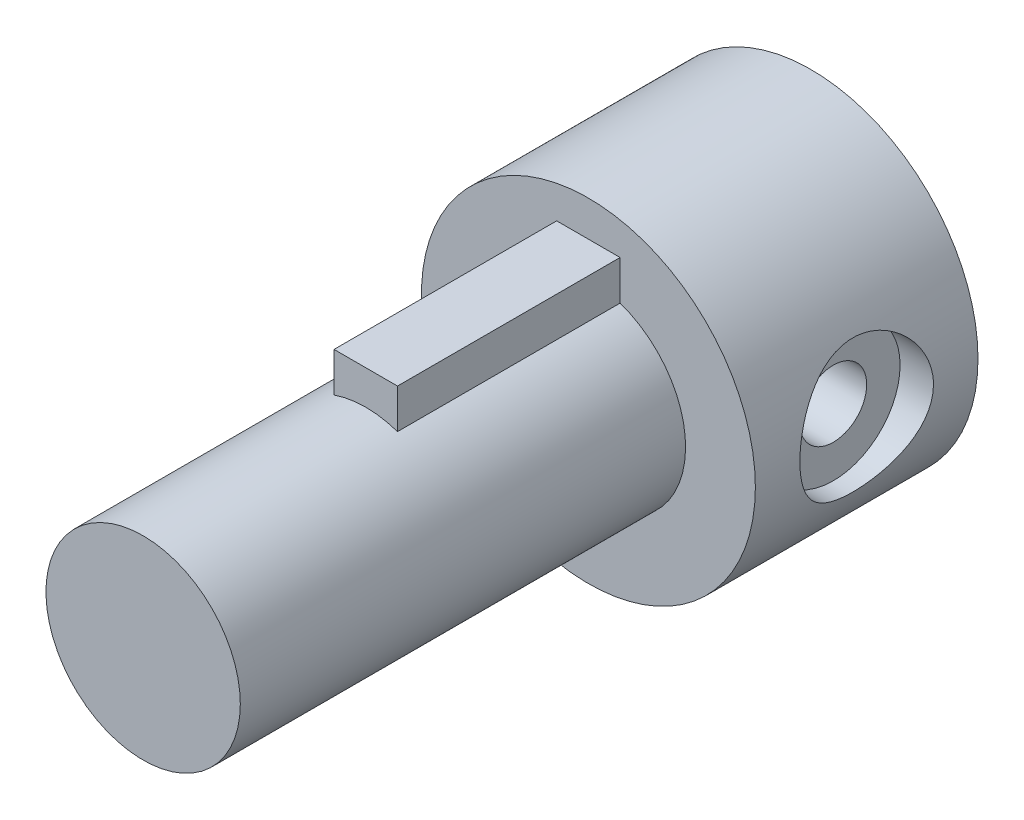
ISO-10303-21;
HEADER;
FILE_DESCRIPTION(('STEP AP214'),'2;1');
FILE_NAME('part.step','',(''),(''),'','','');
FILE_SCHEMA(('AUTOMOTIVE_DESIGN { 1 0 10303 214 1 1 1 1 }'));
ENDSEC;
DATA;
#1=APPLICATION_CONTEXT('core data for automotive mechanical design processes');
#2=APPLICATION_PROTOCOL_DEFINITION('international standard','automotive_design',2000,#1);
#3=PRODUCT_CONTEXT('',#1,'mechanical');
#4=PRODUCT('Part','Part','',(#3));
#5=PRODUCT_RELATED_PRODUCT_CATEGORY('part','',(#4));
#6=PRODUCT_DEFINITION_FORMATION('','',#4);
#7=PRODUCT_DEFINITION_CONTEXT('part definition',#1,'design');
#8=PRODUCT_DEFINITION('design','',#6,#7);
#9=PRODUCT_DEFINITION_SHAPE('','',#8);
#10=(LENGTH_UNIT() NAMED_UNIT(*) SI_UNIT(.MILLI.,.METRE.));
#11=(NAMED_UNIT(*) PLANE_ANGLE_UNIT() SI_UNIT($,.RADIAN.));
#12=(NAMED_UNIT(*) SI_UNIT($,.STERADIAN.) SOLID_ANGLE_UNIT());
#13=UNCERTAINTY_MEASURE_WITH_UNIT(LENGTH_MEASURE(1.E-05),#10,'distance_accuracy_value','');
#14=(GEOMETRIC_REPRESENTATION_CONTEXT(3) GLOBAL_UNCERTAINTY_ASSIGNED_CONTEXT((#13)) GLOBAL_UNIT_ASSIGNED_CONTEXT((#10,
#11,#12)) REPRESENTATION_CONTEXT('',''));
#15=CARTESIAN_POINT('',(0.,0.,0.));
#16=DIRECTION('',(0.,0.,1.));
#17=DIRECTION('',(1.,0.,0.));
#18=AXIS2_PLACEMENT_3D('',#15,#16,#17);
#19=CARTESIAN_POINT('',(6.,0.,5.));
#20=DIRECTION('',(-1.,0.,0.));
#21=DIRECTION('',(0.,0.,1.));
#22=AXIS2_PLACEMENT_3D('',#19,#20,#21);
#23=CYLINDRICAL_SURFACE('',#22,1.5);
#24=CARTESIAN_POINT('',(3.,0.,6.5));
#25=CARTESIAN_POINT('',(2.99999570107562,-0.0788579444268484,6.49999504652421));
#26=CARTESIAN_POINT('',(2.99685736529635,-0.157809899546342,6.49374489031842));
#27=CARTESIAN_POINT('',(2.98461234055736,-0.313380352903342,6.46902067948769));
#28=CARTESIAN_POINT('',(2.9754943174338,-0.389994130070443,6.45052341050328));
#29=CARTESIAN_POINT('',(2.95224419105063,-0.538400317320671,6.40220928707506));
#30=CARTESIAN_POINT('',(2.93813158766306,-0.610210204408718,6.37243642362805));
#31=CARTESIAN_POINT('',(2.90618664773642,-0.747708925209896,6.30264406795252));
#32=CARTESIAN_POINT('',(2.88835460450288,-0.813398240985087,6.2626253836267));
#33=CARTESIAN_POINT('',(2.84934387387093,-0.941261726642862,6.17072412577207));
#34=CARTESIAN_POINT('',(2.82802798691306,-1.00298281668316,6.11827028114054));
#35=CARTESIAN_POINT('',(2.78489955370115,-1.11716916730047,6.00421778112945));
#36=CARTESIAN_POINT('',(2.76308664313552,-1.16962737466015,5.94261222234134));
#37=CARTESIAN_POINT('',(2.71948426796021,-1.26787800067542,5.80627497571493));
#38=CARTESIAN_POINT('',(2.69782780455198,-1.31283800332745,5.73089585248113));
#39=CARTESIAN_POINT('',(2.65928968158481,-1.38925234033604,5.57244899602068));
#40=CARTESIAN_POINT('',(2.64240461410485,-1.4207163224495,5.48938680691588));
#41=CARTESIAN_POINT('',(2.61686800556713,-1.46719866328288,5.32300234186712));
#42=CARTESIAN_POINT('',(2.60778407375571,-1.48308878562066,5.23999332189891));
#43=CARTESIAN_POINT('',(2.59772834922792,-1.50064048996327,5.07203174333078));
#44=CARTESIAN_POINT('',(2.59674854014932,-1.50231613255961,4.98708118869327));
#45=CARTESIAN_POINT('',(2.60266395385873,-1.49203093075844,4.82857096352695));
#46=CARTESIAN_POINT('',(2.6086314549302,-1.48167683930523,4.75486395316543));
#47=CARTESIAN_POINT('',(2.62614343100776,-1.4504097735854,4.61041713594044));
#48=CARTESIAN_POINT('',(2.63768968247665,-1.42949343584648,4.53967828204203));
#49=CARTESIAN_POINT('',(2.66531214619112,-1.377314670579,4.40115630115151));
#50=CARTESIAN_POINT('',(2.68148760995998,-1.34582260067399,4.33348040182132));
#51=CARTESIAN_POINT('',(2.71655106422106,-1.273562531502,4.20404856111499));
#52=CARTESIAN_POINT('',(2.73544027170286,-1.2327903657187,4.14229529659987));
#53=CARTESIAN_POINT('',(2.77669736854929,-1.13709908236918,4.01821812088516));
#54=CARTESIAN_POINT('',(2.79920265355119,-1.08104168755392,3.95681468963576));
#55=CARTESIAN_POINT('',(2.84321434950611,-0.959333368112058,3.84389687211365));
#56=CARTESIAN_POINT('',(2.86472027938202,-0.893677884861426,3.79238721194918));
#57=CARTESIAN_POINT('',(2.90552980924446,-0.75077475874777,3.69847150845541));
#58=CARTESIAN_POINT('',(2.92468476243011,-0.673130387399111,3.65659929133139));
#59=CARTESIAN_POINT('',(2.95736821681864,-0.510699323233193,3.58685445643549));
#60=CARTESIAN_POINT('',(2.9709011841533,-0.425918364397912,3.55897072247725));
#61=CARTESIAN_POINT('',(2.98986500612153,-0.259149737491051,3.52028689442499));
#62=CARTESIAN_POINT('',(2.99587407451965,-0.177512295822487,3.50826314637983));
#63=CARTESIAN_POINT('',(3.00109520188655,-0.0131693999240253,3.49780290329827));
#64=CARTESIAN_POINT('',(3.00031048081978,0.0695355298048653,3.4993599715408));
#65=CARTESIAN_POINT('',(2.99236788380153,0.226849457978983,3.51531003262812));
#66=CARTESIAN_POINT('',(2.98570868532253,0.301589112074897,3.52869879909499));
#67=CARTESIAN_POINT('',(2.9673325697226,0.447610338452914,3.56635710784268));
#68=CARTESIAN_POINT('',(2.95561509501618,0.518891528536633,3.59062784968024));
#69=CARTESIAN_POINT('',(2.92776377120382,0.658332912674362,3.64999769964955));
#70=CARTESIAN_POINT('',(2.91151322654446,0.726345595508707,3.68538657517443));
#71=CARTESIAN_POINT('',(2.87615961476126,0.85569204254891,3.76566130346985));
#72=CARTESIAN_POINT('',(2.85705533350407,0.91702294466489,3.81055120189309));
#73=CARTESIAN_POINT('',(2.81562332004297,1.03765153393383,3.91364063799607));
#74=CARTESIAN_POINT('',(2.79316327265249,1.09615811672854,3.97271430266772));
#75=CARTESIAN_POINT('',(2.7489358741323,1.20278448167829,4.09988772691659));
#76=CARTESIAN_POINT('',(2.72716901100071,1.25089707856781,4.16799367827188));
#77=CARTESIAN_POINT('',(2.68576788309734,1.33756187171853,4.31546548125946));
#78=CARTESIAN_POINT('',(2.66628794383591,1.37553824370037,4.39521689914172));
#79=CARTESIAN_POINT('',(2.63361108441202,1.43712423890206,4.56126510136245));
#80=CARTESIAN_POINT('',(2.62040607332625,1.46075237380053,4.64755328970034));
#81=CARTESIAN_POINT('',(2.60342251538703,1.49079253120031,4.81536533432706));
#82=CARTESIAN_POINT('',(2.59886075197597,1.49863949460818,4.89655138015286));
#83=CARTESIAN_POINT('',(2.59748031962405,1.50103373156431,5.05917060074679));
#84=CARTESIAN_POINT('',(2.60065829439585,1.49558676993486,5.14060365310679));
#85=CARTESIAN_POINT('',(2.61356793076615,1.47288918838997,5.29322525230016));
#86=CARTESIAN_POINT('',(2.62264641723988,1.45681247151455,5.36465070521711));
#87=CARTESIAN_POINT('',(2.64556524281479,1.41476303733662,5.50371217913655));
#88=CARTESIAN_POINT('',(2.65940711354503,1.38878713673988,5.57134697313805));
#89=CARTESIAN_POINT('',(2.69142795546804,1.32572361795085,5.70593727647981));
#90=CARTESIAN_POINT('',(2.70983583593881,1.28800670672355,5.77254185274354));
#91=CARTESIAN_POINT('',(2.74852997452291,1.20322645745609,5.89891180427189));
#92=CARTESIAN_POINT('',(2.76881720693416,1.15615825686234,5.95867359578167));
#93=CARTESIAN_POINT('',(2.81193484737138,1.04730498999206,6.07721297353201));
#94=CARTESIAN_POINT('',(2.83477474959942,0.984426634495893,6.13498865352544));
#95=CARTESIAN_POINT('',(2.87816628389896,0.849232209349796,6.2393944751529));
#96=CARTESIAN_POINT('',(2.89871667939293,0.776911084957796,6.28601860920486));
#97=CARTESIAN_POINT('',(2.93547014349806,0.623897395174419,6.36685454406811));
#98=CARTESIAN_POINT('',(2.95164144740899,0.543149255665097,6.4009762538547));
#99=CARTESIAN_POINT('',(2.9775201194848,0.376113151707131,6.45471225163611));
#100=CARTESIAN_POINT('',(2.98724585044602,0.289841699383651,6.47436777020857));
#101=CARTESIAN_POINT('',(2.99543192870217,0.168902919736344,6.49084611662861));
#102=CARTESIAN_POINT('',(2.99714048010376,0.135242819162348,6.49427396129951));
#103=CARTESIAN_POINT('',(2.99942545465223,0.0677275977076387,6.49885199827113));
#104=CARTESIAN_POINT('',(3.00000184655071,0.0338724714699442,6.50000212770531));
#105=CARTESIAN_POINT('',(3.,0.,6.5));
#106=B_SPLINE_CURVE_WITH_KNOTS('',3,(#24,#25,#26,#27,#28,#29,#30,#31,#32,#33,#34,#35,#36,#37,
#38,#39,#40,#41,#42,#43,#44,#45,#46,#47,#48,#49,#50,#51,#52,#53,#54,#55,#56,#57,#58,#59,#60,#61,
#62,#63,#64,#65,#66,#67,#68,#69,#70,#71,#72,#73,#74,#75,#76,#77,#78,#79,#80,#81,#82,#83,#84,#85,
#86,#87,#88,#89,#90,#91,#92,#93,#94,#95,#96,#97,#98,#99,#100,#101,#102,#103,#104,#105),
.UNSPECIFIED.,.T.,.F.,(4,2,2,2,2,2,2,2,2,2,2,2,2,2,2,2,2,2,2,2,2,2,2,2,2,2,2,2,2,2,2,2,2,2,2,2,
2,2,2,2,4),(0.,0.236436386130439,0.473322224563796,0.709293233238447,0.945245640872351,
1.19547263807713,1.44588935648105,1.71572589646129,1.98536921847421,2.23887018210344,
2.49212035993531,2.71508568613981,2.93812205888518,3.16635360252731,3.39468781890333,
3.65197412000818,3.9093830189803,4.17874533321661,4.44789325368419,4.69474935707019,
4.94148846767214,5.16910359759183,5.39674382446397,5.63089284041848,5.86514176122509,
6.12239415966628,6.37982382923148,6.64972023242589,6.91926767918176,7.1629396125457,
7.40650589797018,7.62686895373284,7.84730293182527,8.08254685170431,8.31791341715446,
8.58187864135757,8.84598575071869,9.1119602049529,9.37717362931724,9.47872920200875,
9.58028757766599),.UNSPECIFIED.);
#107=CARTESIAN_POINT('',(3.,0.,6.5));
#108=VERTEX_POINT('',#107);
#109=EDGE_CURVE('E114',#108,#108,#106,.T.);
#110=ORIENTED_EDGE('',*,*,#109,.F.);
#111=EDGE_LOOP('',(#110));
#112=FACE_BOUND('',#111,.T.);
#113=CARTESIAN_POINT('',(6.,0.,5.));
#114=DIRECTION('',(1.,0.,0.));
#115=DIRECTION('',(0.,0.,-1.));
#116=AXIS2_PLACEMENT_3D('',#113,#114,#115);
#117=CIRCLE('',#116,1.5);
#118=CARTESIAN_POINT('',(6.,0.,3.5));
#119=VERTEX_POINT('',#118);
#120=EDGE_CURVE('E178',#119,#119,#117,.T.);
#121=ORIENTED_EDGE('',*,*,#120,.T.);
#122=EDGE_LOOP('',(#121));
#123=FACE_BOUND('',#122,.T.);
#124=ADVANCED_FACE('F35',(#112,#123),#23,.F.);
#125=CARTESIAN_POINT('',(0.,0.,10.));
#126=DIRECTION('',(0.,0.,1.));
#127=DIRECTION('',(1.,0.,0.));
#128=AXIS2_PLACEMENT_3D('',#125,#126,#127);
#129=PLANE('',#128);
#130=CARTESIAN_POINT('',(0.,0.,10.));
#131=DIRECTION('',(0.,0.,1.));
#132=DIRECTION('',(1.,0.,0.));
#133=AXIS2_PLACEMENT_3D('',#130,#131,#132);
#134=CIRCLE('',#133,7.5);
#135=CARTESIAN_POINT('',(7.5,0.,10.));
#136=VERTEX_POINT('',#135);
#137=EDGE_CURVE('E44',#136,#136,#134,.T.);
#138=ORIENTED_EDGE('',*,*,#137,.T.);
#139=EDGE_LOOP('',(#138));
#140=FACE_BOUND('',#139,.T.);
#141=DIRECTION('',(0.,1.,0.));
#142=VECTOR('',#141,1.);
#143=CARTESIAN_POINT('',(1.425,0.,10.));
#144=LINE('',#143,#142);
#145=CARTESIAN_POINT('',(1.425,4.12584536792158,10.));
#146=VERTEX_POINT('',#145);
#147=CARTESIAN_POINT('',(1.425,5.9,10.));
#148=VERTEX_POINT('',#147);
#149=EDGE_CURVE('E51',#146,#148,#144,.T.);
#150=ORIENTED_EDGE('',*,*,#149,.F.);
#151=CARTESIAN_POINT('',(0.,0.,10.));
#152=DIRECTION('',(0.,0.,1.));
#153=DIRECTION('',(1.,0.,0.));
#154=AXIS2_PLACEMENT_3D('',#151,#152,#153);
#155=CIRCLE('',#154,4.365);
#156=CARTESIAN_POINT('',(-1.425,4.12584536792158,10.));
#157=VERTEX_POINT('',#156);
#158=EDGE_CURVE('E83',#157,#146,#155,.T.);
#159=ORIENTED_EDGE('',*,*,#158,.F.);
#160=DIRECTION('',(0.,1.,0.));
#161=VECTOR('',#160,1.);
#162=CARTESIAN_POINT('',(-1.425,0.,10.));
#163=LINE('',#162,#161);
#164=CARTESIAN_POINT('',(-1.425,5.9,10.));
#165=VERTEX_POINT('',#164);
#166=EDGE_CURVE('E95',#157,#165,#163,.T.);
#167=ORIENTED_EDGE('',*,*,#166,.T.);
#168=DIRECTION('',(1.,0.,0.));
#169=VECTOR('',#168,1.);
#170=CARTESIAN_POINT('',(0.,5.9,10.));
#171=LINE('',#170,#169);
#172=EDGE_CURVE('E56',#165,#148,#171,.T.);
#173=ORIENTED_EDGE('',*,*,#172,.T.);
#174=EDGE_LOOP('',(#150,#159,#167,#173));
#175=FACE_BOUND('',#174,.T.);
#176=ADVANCED_FACE('F156',(#140,#175),#129,.T.);
#177=CARTESIAN_POINT('',(0.,0.,10.));
#178=DIRECTION('',(0.,0.,-1.));
#179=DIRECTION('',(-1.,0.,0.));
#180=AXIS2_PLACEMENT_3D('',#177,#178,#179);
#181=CYLINDRICAL_SURFACE('',#180,3.);
#182=CARTESIAN_POINT('',(0.,0.,0.));
#183=DIRECTION('',(0.,0.,1.));
#184=DIRECTION('',(1.,0.,0.));
#185=AXIS2_PLACEMENT_3D('',#182,#183,#184);
#186=CIRCLE('',#185,3.);
#187=CARTESIAN_POINT('',(3.,0.,0.));
#188=VERTEX_POINT('',#187);
#189=EDGE_CURVE('E217',#188,#188,#186,.T.);
#190=ORIENTED_EDGE('',*,*,#189,.F.);
#191=EDGE_LOOP('',(#190));
#192=FACE_BOUND('',#191,.T.);
#193=CARTESIAN_POINT('',(0.,0.,10.));
#194=DIRECTION('',(0.,0.,1.));
#195=DIRECTION('',(1.,0.,0.));
#196=AXIS2_PLACEMENT_3D('',#193,#194,#195);
#197=CIRCLE('',#196,3.);
#198=CARTESIAN_POINT('',(3.,0.,10.));
#199=VERTEX_POINT('',#198);
#200=EDGE_CURVE('E85',#199,#199,#197,.T.);
#201=ORIENTED_EDGE('',*,*,#200,.T.);
#202=EDGE_LOOP('',(#201));
#203=FACE_BOUND('',#202,.T.);
#204=ORIENTED_EDGE('',*,*,#109,.T.);
#205=EDGE_LOOP('',(#204));
#206=FACE_BOUND('',#205,.T.);
#207=CARTESIAN_POINT('',(-3.,0.,6.5));
#208=CARTESIAN_POINT('',(-2.99999570107562,0.0788579444268519,6.49999504652421));
#209=CARTESIAN_POINT('',(-2.99685736529635,0.157809899546346,6.49374489031842));
#210=CARTESIAN_POINT('',(-2.98461234055736,0.313380352903346,6.46902067948769));
#211=CARTESIAN_POINT('',(-2.97549431743379,0.389994130070446,6.45052341050328));
#212=CARTESIAN_POINT('',(-2.95224419105063,0.538400317320676,6.40220928707506));
#213=CARTESIAN_POINT('',(-2.93813158766306,0.610210204408722,6.37243642362805));
#214=CARTESIAN_POINT('',(-2.90618664773642,0.747708925209901,6.30264406795252));
#215=CARTESIAN_POINT('',(-2.88835460450288,0.813398240985091,6.2626253836267));
#216=CARTESIAN_POINT('',(-2.84934387387093,0.941261726642866,6.17072412577207));
#217=CARTESIAN_POINT('',(-2.82802798691306,1.00298281668317,6.11827028114054));
#218=CARTESIAN_POINT('',(-2.78489955370115,1.11716916730047,6.00421778112945));
#219=CARTESIAN_POINT('',(-2.76308664313552,1.16962737466015,5.94261222234134));
#220=CARTESIAN_POINT('',(-2.71948426796021,1.26787800067542,5.80627497571493));
#221=CARTESIAN_POINT('',(-2.69782780455198,1.31283800332746,5.73089585248113));
#222=CARTESIAN_POINT('',(-2.65928968158481,1.38925234033605,5.57244899602068));
#223=CARTESIAN_POINT('',(-2.64240461410484,1.4207163224495,5.48938680691588));
#224=CARTESIAN_POINT('',(-2.61686800556713,1.46719866328288,5.32300234186711));
#225=CARTESIAN_POINT('',(-2.6077840737557,1.48308878562066,5.23999332189891));
#226=CARTESIAN_POINT('',(-2.59772834922792,1.50064048996327,5.07203174333078));
#227=CARTESIAN_POINT('',(-2.59674854014932,1.50231613255961,4.98708118869327));
#228=CARTESIAN_POINT('',(-2.60266395385873,1.49203093075844,4.82857096352695));
#229=CARTESIAN_POINT('',(-2.6086314549302,1.48167683930523,4.75486395316542));
#230=CARTESIAN_POINT('',(-2.62614343100775,1.4504097735854,4.61041713594044));
#231=CARTESIAN_POINT('',(-2.63768968247664,1.42949343584648,4.53967828204203));
#232=CARTESIAN_POINT('',(-2.66531214619112,1.37731467057901,4.40115630115151));
#233=CARTESIAN_POINT('',(-2.68148760995998,1.34582260067399,4.33348040182132));
#234=CARTESIAN_POINT('',(-2.71655106422106,1.27356253150201,4.20404856111499));
#235=CARTESIAN_POINT('',(-2.73544027170286,1.2327903657187,4.14229529659987));
#236=CARTESIAN_POINT('',(-2.77669736854929,1.13709908236918,4.01821812088516));
#237=CARTESIAN_POINT('',(-2.79920265355119,1.08104168755392,3.95681468963576));
#238=CARTESIAN_POINT('',(-2.84321434950611,0.959333368112062,3.84389687211365));
#239=CARTESIAN_POINT('',(-2.86472027938201,0.89367788486143,3.79238721194918));
#240=CARTESIAN_POINT('',(-2.90552980924446,0.750774758747774,3.69847150845541));
#241=CARTESIAN_POINT('',(-2.92468476243011,0.673130387399115,3.65659929133139));
#242=CARTESIAN_POINT('',(-2.95736821681864,0.510699323233197,3.58685445643549));
#243=CARTESIAN_POINT('',(-2.9709011841533,0.425918364397915,3.55897072247725));
#244=CARTESIAN_POINT('',(-2.98986500612153,0.259149737491055,3.52028689442498));
#245=CARTESIAN_POINT('',(-2.99587407451965,0.17751229582249,3.50826314637983));
#246=CARTESIAN_POINT('',(-3.00109520188656,0.0131693999240285,3.49780290329827));
#247=CARTESIAN_POINT('',(-3.00031048081978,-0.069535529804862,3.4993599715408));
#248=CARTESIAN_POINT('',(-2.99236788380153,-0.226849457978979,3.51531003262812));
#249=CARTESIAN_POINT('',(-2.98570868532253,-0.301589112074894,3.52869879909499));
#250=CARTESIAN_POINT('',(-2.9673325697226,-0.44761033845291,3.56635710784268));
#251=CARTESIAN_POINT('',(-2.95561509501618,-0.518891528536629,3.59062784968024));
#252=CARTESIAN_POINT('',(-2.92776377120382,-0.658332912674358,3.64999769964955));
#253=CARTESIAN_POINT('',(-2.91151322654446,-0.726345595508704,3.68538657517443));
#254=CARTESIAN_POINT('',(-2.87615961476127,-0.855692042548906,3.76566130346985));
#255=CARTESIAN_POINT('',(-2.85705533350408,-0.917022944664886,3.81055120189309));
#256=CARTESIAN_POINT('',(-2.81562332004297,-1.03765153393382,3.91364063799607));
#257=CARTESIAN_POINT('',(-2.79316327265249,-1.09615811672854,3.97271430266772));
#258=CARTESIAN_POINT('',(-2.7489358741323,-1.20278448167828,4.09988772691659));
#259=CARTESIAN_POINT('',(-2.72716901100071,-1.25089707856781,4.16799367827188));
#260=CARTESIAN_POINT('',(-2.68576788309734,-1.33756187171852,4.31546548125946));
#261=CARTESIAN_POINT('',(-2.66628794383591,-1.37553824370037,4.39521689914172));
#262=CARTESIAN_POINT('',(-2.63361108441202,-1.43712423890205,4.56126510136245));
#263=CARTESIAN_POINT('',(-2.62040607332625,-1.46075237380052,4.64755328970034));
#264=CARTESIAN_POINT('',(-2.60342251538703,-1.49079253120031,4.81536533432706));
#265=CARTESIAN_POINT('',(-2.59886075197598,-1.49863949460818,4.89655138015286));
#266=CARTESIAN_POINT('',(-2.59748031962405,-1.5010337315643,5.05917060074679));
#267=CARTESIAN_POINT('',(-2.60065829439585,-1.49558676993486,5.14060365310679));
#268=CARTESIAN_POINT('',(-2.61356793076615,-1.47288918838996,5.29322525230016));
#269=CARTESIAN_POINT('',(-2.62264641723988,-1.45681247151455,5.36465070521711));
#270=CARTESIAN_POINT('',(-2.64556524281479,-1.41476303733662,5.50371217913655));
#271=CARTESIAN_POINT('',(-2.65940711354503,-1.38878713673988,5.57134697313805));
#272=CARTESIAN_POINT('',(-2.69142795546804,-1.32572361795084,5.70593727647981));
#273=CARTESIAN_POINT('',(-2.70983583593881,-1.28800670672355,5.77254185274354));
#274=CARTESIAN_POINT('',(-2.74852997452291,-1.20322645745609,5.89891180427189));
#275=CARTESIAN_POINT('',(-2.76881720693416,-1.15615825686234,5.95867359578167));
#276=CARTESIAN_POINT('',(-2.81193484737138,-1.04730498999206,6.07721297353201));
#277=CARTESIAN_POINT('',(-2.83477474959942,-0.984426634495889,6.13498865352544));
#278=CARTESIAN_POINT('',(-2.87816628389896,-0.849232209349793,6.2393944751529));
#279=CARTESIAN_POINT('',(-2.89871667939293,-0.776911084957793,6.28601860920486));
#280=CARTESIAN_POINT('',(-2.93547014349806,-0.623897395174415,6.36685454406811));
#281=CARTESIAN_POINT('',(-2.95164144740899,-0.543149255665093,6.4009762538547));
#282=CARTESIAN_POINT('',(-2.9775201194848,-0.376113151707127,6.45471225163611));
#283=CARTESIAN_POINT('',(-2.98724585044602,-0.289841699383647,6.47436777020857));
#284=CARTESIAN_POINT('',(-2.99543192870217,-0.16890291973634,6.49084611662861));
#285=CARTESIAN_POINT('',(-2.99714048010376,-0.135242819162345,6.49427396129951));
#286=CARTESIAN_POINT('',(-2.99942545465223,-0.0677275977076353,6.49885199827113));
#287=CARTESIAN_POINT('',(-3.00000184655071,-0.0338724714699407,6.50000212770531));
#288=CARTESIAN_POINT('',(-3.,0.,6.5));
#289=B_SPLINE_CURVE_WITH_KNOTS('',3,(#207,#208,#209,#210,#211,#212,#213,#214,#215,#216,#217,
#218,#219,#220,#221,#222,#223,#224,#225,#226,#227,#228,#229,#230,#231,#232,#233,#234,#235,#236,
#237,#238,#239,#240,#241,#242,#243,#244,#245,#246,#247,#248,#249,#250,#251,#252,#253,#254,#255,
#256,#257,#258,#259,#260,#261,#262,#263,#264,#265,#266,#267,#268,#269,#270,#271,#272,#273,#274,
#275,#276,#277,#278,#279,#280,#281,#282,#283,#284,#285,#286,#287,#288),.UNSPECIFIED.,.T.,.F.,(4,
2,2,2,2,2,2,2,2,2,2,2,2,2,2,2,2,2,2,2,2,2,2,2,2,2,2,2,2,2,2,2,2,2,2,2,2,2,2,2,4),(0.,
0.236436386130439,0.473322224563797,0.709293233238449,0.945245640872352,1.19547263807713,
1.44588935648105,1.71572589646129,1.98536921847422,2.23887018210345,2.49212035993531,
2.71508568613981,2.93812205888518,3.16635360252731,3.39468781890333,3.65197412000818,
3.9093830189803,4.17874533321661,4.4478932536842,4.69474935707019,4.94148846767214,
5.16910359759183,5.39674382446397,5.63089284041848,5.86514176122509,6.12239415966628,
6.37982382923148,6.64972023242589,6.91926767918176,7.1629396125457,7.40650589797018,
7.62686895373284,7.84730293182527,8.08254685170431,8.31791341715446,8.58187864135757,
8.84598575071869,9.1119602049529,9.37717362931724,9.47872920200875,9.58028757766599),.UNSPECIFIED.);
#290=CARTESIAN_POINT('',(-3.,0.,6.5));
#291=VERTEX_POINT('',#290);
#292=EDGE_CURVE('E104',#291,#291,#289,.T.);
#293=ORIENTED_EDGE('',*,*,#292,.T.);
#294=EDGE_LOOP('',(#293));
#295=FACE_BOUND('',#294,.T.);
#296=ADVANCED_FACE('F161',(#192,#203,#206,#295),#181,.F.);
#297=CARTESIAN_POINT('',(-7.5,0.,5.));
#298=DIRECTION('',(1.,0.,0.));
#299=DIRECTION('',(0.,0.,-1.));
#300=AXIS2_PLACEMENT_3D('',#297,#298,#299);
#301=CYLINDRICAL_SURFACE('',#300,3.);
#302=CARTESIAN_POINT('',(-7.5,0.,2.));
#303=CARTESIAN_POINT('',(-7.49999888970472,0.0806632009395374,2.0000016109771));
#304=CARTESIAN_POINT('',(-7.4986936895007,0.161354413498375,2.00325988452));
#305=CARTESIAN_POINT('',(-7.49351186176526,0.322146094522255,2.0162529045329));
#306=CARTESIAN_POINT('',(-7.48963361174618,0.402246157981984,2.02599173745989));
#307=CARTESIAN_POINT('',(-7.47424634808757,0.641096781067454,2.0648711401178));
#308=CARTESIAN_POINT('',(-7.45898522266242,0.798158082521721,2.10367430754478));
#309=CARTESIAN_POINT('',(-7.42011459126984,1.10247033899881,2.20531422781089));
#310=CARTESIAN_POINT('',(-7.39653243529674,1.24975157753076,2.26807229903017));
#311=CARTESIAN_POINT('',(-7.34334877224069,1.53159737405797,2.41552873029505));
#312=CARTESIAN_POINT('',(-7.31374935540466,1.66616632427491,2.50021947426576));
#313=CARTESIAN_POINT('',(-7.24996340359365,1.92525452632722,2.69335325630236));
#314=CARTESIAN_POINT('',(-7.21563448373939,2.04909421803168,2.80265998663132));
#315=CARTESIAN_POINT('',(-7.14690862377684,2.27726169757605,3.04010000294314));
#316=CARTESIAN_POINT('',(-7.11251165865921,2.38157993941976,3.1682424451965));
#317=CARTESIAN_POINT('',(-7.04584188546733,2.5723120820679,3.44664210601216));
#318=CARTESIAN_POINT('',(-7.01373174174385,2.65772253361338,3.59762972920882));
#319=CARTESIAN_POINT('',(-6.95750470553338,2.80163201676496,3.91330459745613));
#320=CARTESIAN_POINT('',(-6.93338401809297,2.86014383023325,4.0779852917251));
#321=CARTESIAN_POINT('',(-6.8973953654561,2.94584825055478,4.40856850043345));
#322=CARTESIAN_POINT('',(-6.88502130539265,2.974340952837,4.57407685338287));
#323=CARTESIAN_POINT('',(-6.87246006067861,3.00325943833355,4.90795249744237));
#324=CARTESIAN_POINT('',(-6.87226688315068,3.00369902341367,5.07631834190864));
#325=CARTESIAN_POINT('',(-6.88365750391268,2.97748405223856,5.39863500722533));
#326=CARTESIAN_POINT('',(-6.89442262441713,2.95271297167583,5.55277357172386));
#327=CARTESIAN_POINT('',(-6.92514281294201,2.87992032013237,5.85448933411311));
#328=CARTESIAN_POINT('',(-6.94509948450627,2.83189469212407,6.00206538218921));
#329=CARTESIAN_POINT('',(-6.99239227665171,2.71304209891513,6.29002675426026));
#330=CARTESIAN_POINT('',(-7.01987068929879,2.64176979349676,6.43020385857295));
#331=CARTESIAN_POINT('',(-7.07907174576133,2.47875969107453,6.69712372455143));
#332=CARTESIAN_POINT('',(-7.11079598182861,2.38701420764467,6.82386141410673));
#333=CARTESIAN_POINT('',(-7.17790105116005,2.17732589918876,7.07061459320028));
#334=CARTESIAN_POINT('',(-7.21337497464924,2.05790619445786,7.1893530941683));
#335=CARTESIAN_POINT('',(-7.28189737436726,1.80047164114338,7.40552671700379));
#336=CARTESIAN_POINT('',(-7.31494536667799,1.66245309800114,7.50295759611564));
#337=CARTESIAN_POINT('',(-7.37572021897015,1.36811647890929,7.67542617112355));
#338=CARTESIAN_POINT('',(-7.40332905143173,1.21149073701986,7.74998342179553));
#339=CARTESIAN_POINT('',(-7.44922242493087,0.886535648224186,7.87125179161714));
#340=CARTESIAN_POINT('',(-7.4675117019356,0.718212295274481,7.91797705633613));
#341=CARTESIAN_POINT('',(-7.49184209260378,0.385343831411762,7.97967244312955));
#342=CARTESIAN_POINT('',(-7.49854418750274,0.221164940978296,7.99635868138034));
#343=CARTESIAN_POINT('',(-7.50102717765943,-0.107767964711716,8.00256965079292));
#344=CARTESIAN_POINT('',(-7.49681090373437,-0.272521819835822,7.99210142232125));
#345=CARTESIAN_POINT('',(-7.4783635059563,-0.590149108683039,7.94556237117203));
#346=CARTESIAN_POINT('',(-7.46459087018283,-0.743223737663435,7.91066302947361));
#347=CARTESIAN_POINT('',(-7.42889162108252,-1.04120314209094,7.8178464375352));
#348=CARTESIAN_POINT('',(-7.40696396034803,-1.18610686533642,7.7599262304967));
#349=CARTESIAN_POINT('',(-7.3562489215621,-1.46861817872592,7.62082259048036));
#350=CARTESIAN_POINT('',(-7.32727223969677,-1.60586703413639,7.53898179193636));
#351=CARTESIAN_POINT('',(-7.26560047118315,-1.86516538686655,7.35508951414045));
#352=CARTESIAN_POINT('',(-7.23290389665513,-1.98720876112942,7.25302993561202));
#353=CARTESIAN_POINT('',(-7.16467676457054,-2.2210845645563,7.02369498057988));
#354=CARTESIAN_POINT('',(-7.12910162137139,-2.33171090075939,6.89519968775731));
#355=CARTESIAN_POINT('',(-7.06112509376137,-2.53012679607026,6.62083987546932));
#356=CARTESIAN_POINT('',(-7.02872423291408,-2.6179125918181,6.47497249942789));
#357=CARTESIAN_POINT('',(-6.97071449859905,-2.76871125308742,6.16780745817163));
#358=CARTESIAN_POINT('',(-6.94517446320966,-2.83147589251401,6.00637400141696));
#359=CARTESIAN_POINT('',(-6.90485510223108,-2.92844432884615,5.67389952219201));
#360=CARTESIAN_POINT('',(-6.89006783567176,-2.96266920524751,5.5028656904034));
#361=CARTESIAN_POINT('',(-6.87407638928379,-2.9995734283829,5.16930814815297));
#362=CARTESIAN_POINT('',(-6.87197131434659,-3.00434563234764,5.00705774354923));
#363=CARTESIAN_POINT('',(-6.87922254127235,-2.98770473002408,4.68418271049117));
#364=CARTESIAN_POINT('',(-6.88857738776018,-2.96629494876877,4.5235578782059));
#365=CARTESIAN_POINT('',(-6.91689973341125,-2.89960708102334,4.21500172572502));
#366=CARTESIAN_POINT('',(-6.93547246725062,-2.85530635681061,4.06681962683875));
#367=CARTESIAN_POINT('',(-6.97986002865438,-2.7450080562502,3.77993201708089));
#368=CARTESIAN_POINT('',(-7.00567685597585,-2.6790044878915,3.64122913614683));
#369=CARTESIAN_POINT('',(-7.06347910401242,-2.52280960319953,3.36858572281377));
#370=CARTESIAN_POINT('',(-7.09573308125317,-2.43144976133988,3.23537257602419));
#371=CARTESIAN_POINT('',(-7.16195721907533,-2.2288364197758,2.98550944279903));
#372=CARTESIAN_POINT('',(-7.1959278947067,-2.11757692397659,2.86886446768675));
#373=CARTESIAN_POINT('',(-7.26440289511609,-1.86976526416226,2.64769803518517));
#374=CARTESIAN_POINT('',(-7.29879901943986,-1.73204093441049,2.54445294094406));
#375=CARTESIAN_POINT('',(-7.36200845178942,-1.43982353523661,2.36248553064486));
#376=CARTESIAN_POINT('',(-7.39081916114845,-1.28532271229705,2.28377461904378));
#377=CARTESIAN_POINT('',(-7.42714827886078,-1.04589046292377,2.18692649911121));
#378=CARTESIAN_POINT('',(-7.438042523706,-0.965550642326294,2.15834402987599));
#379=CARTESIAN_POINT('',(-7.45739623794253,-0.802472015195123,2.10806234170567));
#380=CARTESIAN_POINT('',(-7.46585684248286,-0.719734347003779,2.08635991315522));
#381=CARTESIAN_POINT('',(-7.48007543500346,-0.552707555877385,2.05011796903622));
#382=CARTESIAN_POINT('',(-7.48584027408325,-0.468422937872985,2.03556029086209));
#383=CARTESIAN_POINT('',(-7.49452509406316,-0.298814608941237,2.01369634720849));
#384=CARTESIAN_POINT('',(-7.49744709693401,-0.213491680311735,2.00638492774934));
#385=CARTESIAN_POINT('',(-7.49963590220856,-0.0853730051865993,2.00091047959473));
#386=CARTESIAN_POINT('',(-7.50000058761588,-0.0426904255930852,1.99999914740183));
#387=CARTESIAN_POINT('',(-7.5,0.,2.));
#388=B_SPLINE_CURVE_WITH_KNOTS('',3,(#302,#303,#304,#305,#306,#307,#308,#309,#310,#311,#312,
#313,#314,#315,#316,#317,#318,#319,#320,#321,#322,#323,#324,#325,#326,#327,#328,#329,#330,#331,
#332,#333,#334,#335,#336,#337,#338,#339,#340,#341,#342,#343,#344,#345,#346,#347,#348,#349,#350,
#351,#352,#353,#354,#355,#356,#357,#358,#359,#360,#361,#362,#363,#364,#365,#366,#367,#368,#369,
#370,#371,#372,#373,#374,#375,#376,#377,#378,#379,#380,#381,#382,#383,#384,#385,#386,#387),
.UNSPECIFIED.,.T.,.F.,(4,2,2,2,2,2,2,2,2,2,2,2,2,2,2,2,2,2,2,2,2,2,2,2,2,2,2,2,2,2,2,2,2,2,2,2,
2,2,2,2,2,2,4),(0.,0.241952995066616,0.484058703589861,0.968979675762156,1.45232140795763,
1.93549552527002,2.43941494725621,2.94358014576643,3.47018310403851,3.99653556852427,
4.49901580138268,5.00124881685757,5.46852914780512,5.93589103065597,6.4127911162975,
6.88987055088801,7.40382945961362,7.91789061441125,8.44210791925736,8.96605856352212,
9.45899198973537,9.95179762536649,10.4224610552807,10.8931849567222,11.3783069227892,
11.8636236142998,12.3809813411815,12.8984242574715,13.4208798989277,13.9429493115043,
14.4274493227065,14.9118878102609,15.3771690000468,15.8425787588927,16.3346362426656,
16.8268422420412,17.3509605748228,17.8753221764233,18.1329380344125,18.3904335342851,
18.6472710222664,18.9039257004315,19.0319776028183),.UNSPECIFIED.);
#389=CARTESIAN_POINT('',(-7.5,0.,2.));
#390=VERTEX_POINT('',#389);
#391=EDGE_CURVE('E192',#390,#390,#388,.T.);
#392=ORIENTED_EDGE('',*,*,#391,.F.);
#393=EDGE_LOOP('',(#392));
#394=FACE_BOUND('',#393,.T.);
#395=CARTESIAN_POINT('',(-6.,0.,5.));
#396=DIRECTION('',(1.,0.,0.));
#397=DIRECTION('',(0.,0.,-1.));
#398=AXIS2_PLACEMENT_3D('',#395,#396,#397);
#399=CIRCLE('',#398,3.);
#400=CARTESIAN_POINT('',(-6.,0.,2.));
#401=VERTEX_POINT('',#400);
#402=EDGE_CURVE('E11',#401,#401,#399,.F.);
#403=ORIENTED_EDGE('',*,*,#402,.F.);
#404=EDGE_LOOP('',(#403));
#405=FACE_BOUND('',#404,.T.);
#406=ADVANCED_FACE('F173',(#394,#405),#301,.F.);
#407=CARTESIAN_POINT('',(0.,0.,0.));
#408=DIRECTION('',(0.,0.,1.));
#409=DIRECTION('',(1.,0.,0.));
#410=AXIS2_PLACEMENT_3D('',#407,#408,#409);
#411=PLANE('',#410);
#412=CARTESIAN_POINT('',(0.,0.,0.));
#413=DIRECTION('',(0.,0.,1.));
#414=DIRECTION('',(1.,0.,0.));
#415=AXIS2_PLACEMENT_3D('',#412,#413,#414);
#416=CIRCLE('',#415,7.5);
#417=CARTESIAN_POINT('',(7.5,0.,0.));
#418=VERTEX_POINT('',#417);
#419=EDGE_CURVE('E214',#418,#418,#416,.T.);
#420=ORIENTED_EDGE('',*,*,#419,.F.);
#421=EDGE_LOOP('',(#420));
#422=FACE_BOUND('',#421,.T.);
#423=ORIENTED_EDGE('',*,*,#189,.T.);
#424=EDGE_LOOP('',(#423));
#425=FACE_BOUND('',#424,.T.);
#426=ADVANCED_FACE('F200',(#422,#425),#411,.F.);
#427=CARTESIAN_POINT('',(0.,0.,10.));
#428=DIRECTION('',(0.,0.,-1.));
#429=DIRECTION('',(-1.,0.,0.));
#430=AXIS2_PLACEMENT_3D('',#427,#428,#429);
#431=CYLINDRICAL_SURFACE('',#430,7.5);
#432=ORIENTED_EDGE('',*,*,#391,.T.);
#433=EDGE_LOOP('',(#432));
#434=FACE_BOUND('',#433,.T.);
#435=CARTESIAN_POINT('',(7.5,0.,2.));
#436=CARTESIAN_POINT('',(7.49999888970472,-0.0806632009395357,2.0000016109771));
#437=CARTESIAN_POINT('',(7.4986936895007,-0.161354413498373,2.00325988452));
#438=CARTESIAN_POINT('',(7.49351186176526,-0.322146094522253,2.0162529045329));
#439=CARTESIAN_POINT('',(7.48963361174618,-0.402246157981983,2.02599173745989));
#440=CARTESIAN_POINT('',(7.47424634808757,-0.641096781067452,2.0648711401178));
#441=CARTESIAN_POINT('',(7.45898522266242,-0.798158082521719,2.10367430754478));
#442=CARTESIAN_POINT('',(7.42011459126984,-1.10247033899881,2.20531422781089));
#443=CARTESIAN_POINT('',(7.39653243529675,-1.24975157753076,2.26807229903017));
#444=CARTESIAN_POINT('',(7.34334877224069,-1.53159737405797,2.41552873029505));
#445=CARTESIAN_POINT('',(7.31374935540466,-1.66616632427491,2.50021947426577));
#446=CARTESIAN_POINT('',(7.24996340359365,-1.92525452632722,2.69335325630236));
#447=CARTESIAN_POINT('',(7.2156344837394,-2.04909421803168,2.80265998663132));
#448=CARTESIAN_POINT('',(7.14690862377684,-2.27726169757605,3.04010000294314));
#449=CARTESIAN_POINT('',(7.11251165865921,-2.38157993941976,3.1682424451965));
#450=CARTESIAN_POINT('',(7.04584188546733,-2.5723120820679,3.44664210601216));
#451=CARTESIAN_POINT('',(7.01373174174385,-2.65772253361338,3.59762972920882));
#452=CARTESIAN_POINT('',(6.95750470553339,-2.80163201676496,3.91330459745613));
#453=CARTESIAN_POINT('',(6.93338401809297,-2.86014383023324,4.0779852917251));
#454=CARTESIAN_POINT('',(6.8973953654561,-2.94584825055478,4.40856850043345));
#455=CARTESIAN_POINT('',(6.88502130539265,-2.974340952837,4.57407685338287));
#456=CARTESIAN_POINT('',(6.87246006067861,-3.00325943833354,4.90795249744237));
#457=CARTESIAN_POINT('',(6.87226688315068,-3.00369902341366,5.07631834190865));
#458=CARTESIAN_POINT('',(6.88365750391268,-2.97748405223855,5.39863500722533));
#459=CARTESIAN_POINT('',(6.89442262441714,-2.95271297167583,5.55277357172386));
#460=CARTESIAN_POINT('',(6.92514281294202,-2.87992032013237,5.85448933411311));
#461=CARTESIAN_POINT('',(6.94509948450627,-2.83189469212407,6.00206538218922));
#462=CARTESIAN_POINT('',(6.99239227665171,-2.71304209891512,6.29002675426027));
#463=CARTESIAN_POINT('',(7.0198706892988,-2.64176979349675,6.43020385857296));
#464=CARTESIAN_POINT('',(7.07907174576133,-2.47875969107453,6.69712372455143));
#465=CARTESIAN_POINT('',(7.11079598182861,-2.38701420764467,6.82386141410673));
#466=CARTESIAN_POINT('',(7.17790105116005,-2.17732589918875,7.07061459320029));
#467=CARTESIAN_POINT('',(7.21337497464924,-2.05790619445785,7.1893530941683));
#468=CARTESIAN_POINT('',(7.28189737436726,-1.80047164114338,7.40552671700379));
#469=CARTESIAN_POINT('',(7.31494536667799,-1.66245309800113,7.50295759611564));
#470=CARTESIAN_POINT('',(7.37572021897015,-1.36811647890929,7.67542617112355));
#471=CARTESIAN_POINT('',(7.40332905143173,-1.21149073701985,7.74998342179553));
#472=CARTESIAN_POINT('',(7.44922242493087,-0.88653564822418,7.87125179161714));
#473=CARTESIAN_POINT('',(7.4675117019356,-0.718212295274475,7.91797705633613));
#474=CARTESIAN_POINT('',(7.49184209260378,-0.385343831411755,7.97967244312955));
#475=CARTESIAN_POINT('',(7.49854418750274,-0.221164940978289,7.99635868138034));
#476=CARTESIAN_POINT('',(7.50102717765943,0.107767964711722,8.00256965079292));
#477=CARTESIAN_POINT('',(7.49681090373437,0.272521819835827,7.99210142232125));
#478=CARTESIAN_POINT('',(7.4783635059563,0.590149108683044,7.94556237117203));
#479=CARTESIAN_POINT('',(7.46459087018283,0.743223737663441,7.91066302947361));
#480=CARTESIAN_POINT('',(7.42889162108252,1.04120314209095,7.8178464375352));
#481=CARTESIAN_POINT('',(7.40696396034803,1.18610686533643,7.7599262304967));
#482=CARTESIAN_POINT('',(7.3562489215621,1.46861817872592,7.62082259048036));
#483=CARTESIAN_POINT('',(7.32727223969677,1.60586703413639,7.53898179193636));
#484=CARTESIAN_POINT('',(7.26560047118315,1.86516538686655,7.35508951414045));
#485=CARTESIAN_POINT('',(7.23290389665512,1.98720876112943,7.25302993561202));
#486=CARTESIAN_POINT('',(7.16467676457053,2.22108456455631,7.02369498057988));
#487=CARTESIAN_POINT('',(7.12910162137139,2.3317109007594,6.89519968775731));
#488=CARTESIAN_POINT('',(7.06112509376137,2.53012679607026,6.62083987546932));
#489=CARTESIAN_POINT('',(7.02872423291408,2.61791259181811,6.47497249942789));
#490=CARTESIAN_POINT('',(6.97071449859905,2.76871125308743,6.16780745817163));
#491=CARTESIAN_POINT('',(6.94517446320966,2.83147589251401,6.00637400141696));
#492=CARTESIAN_POINT('',(6.90485510223108,2.92844432884615,5.67389952219201));
#493=CARTESIAN_POINT('',(6.89006783567176,2.96266920524751,5.50286569040339));
#494=CARTESIAN_POINT('',(6.87407638928378,2.9995734283829,5.16930814815297));
#495=CARTESIAN_POINT('',(6.87197131434659,3.00434563234764,5.00705774354923));
#496=CARTESIAN_POINT('',(6.87922254127235,2.98770473002408,4.68418271049117));
#497=CARTESIAN_POINT('',(6.88857738776018,2.96629494876878,4.5235578782059));
#498=CARTESIAN_POINT('',(6.91689973341124,2.89960708102334,4.21500172572502));
#499=CARTESIAN_POINT('',(6.93547246725061,2.85530635681061,4.06681962683875));
#500=CARTESIAN_POINT('',(6.97986002865438,2.7450080562502,3.77993201708089));
#501=CARTESIAN_POINT('',(7.00567685597585,2.67900448789151,3.64122913614683));
#502=CARTESIAN_POINT('',(7.06347910401242,2.52280960319953,3.36858572281377));
#503=CARTESIAN_POINT('',(7.09573308125317,2.43144976133989,3.23537257602418));
#504=CARTESIAN_POINT('',(7.16195721907533,2.2288364197758,2.98550944279903));
#505=CARTESIAN_POINT('',(7.1959278947067,2.1175769239766,2.86886446768675));
#506=CARTESIAN_POINT('',(7.26440289511609,1.86976526416226,2.64769803518517));
#507=CARTESIAN_POINT('',(7.29879901943986,1.73204093441049,2.54445294094406));
#508=CARTESIAN_POINT('',(7.36200845178942,1.43982353523661,2.36248553064486));
#509=CARTESIAN_POINT('',(7.39081916114845,1.28532271229705,2.28377461904378));
#510=CARTESIAN_POINT('',(7.42714827886077,1.04589046292377,2.18692649911121));
#511=CARTESIAN_POINT('',(7.438042523706,0.965550642326295,2.15834402987599));
#512=CARTESIAN_POINT('',(7.45739623794253,0.802472015195126,2.10806234170567));
#513=CARTESIAN_POINT('',(7.46585684248286,0.719734347003783,2.08635991315522));
#514=CARTESIAN_POINT('',(7.48007543500346,0.55270755587739,2.05011796903622));
#515=CARTESIAN_POINT('',(7.48584027408325,0.46842293787299,2.0355602908621));
#516=CARTESIAN_POINT('',(7.49452509406316,0.298814608941241,2.01369634720849));
#517=CARTESIAN_POINT('',(7.49744709693401,0.213491680311739,2.00638492774934));
#518=CARTESIAN_POINT('',(7.49963590220856,0.0853730051866012,2.00091047959473));
#519=CARTESIAN_POINT('',(7.50000058761588,0.042690425593087,1.99999914740183));
#520=CARTESIAN_POINT('',(7.5,0.,2.));
#521=B_SPLINE_CURVE_WITH_KNOTS('',3,(#435,#436,#437,#438,#439,#440,#441,#442,#443,#444,#445,
#446,#447,#448,#449,#450,#451,#452,#453,#454,#455,#456,#457,#458,#459,#460,#461,#462,#463,#464,
#465,#466,#467,#468,#469,#470,#471,#472,#473,#474,#475,#476,#477,#478,#479,#480,#481,#482,#483,
#484,#485,#486,#487,#488,#489,#490,#491,#492,#493,#494,#495,#496,#497,#498,#499,#500,#501,#502,
#503,#504,#505,#506,#507,#508,#509,#510,#511,#512,#513,#514,#515,#516,#517,#518,#519,#520),
.UNSPECIFIED.,.T.,.F.,(4,2,2,2,2,2,2,2,2,2,2,2,2,2,2,2,2,2,2,2,2,2,2,2,2,2,2,2,2,2,2,2,2,2,2,2,
2,2,2,2,2,2,4),(0.,0.241952995066616,0.484058703589861,0.968979675762157,1.45232140795763,
1.93549552527002,2.43941494725621,2.94358014576643,3.47018310403851,3.99653556852428,
4.49901580138268,5.00124881685757,5.46852914780512,5.93589103065597,6.4127911162975,
6.88987055088801,7.40382945961362,7.91789061441125,8.44210791925736,8.96605856352212,
9.45899198973537,9.95179762536649,10.4224610552807,10.8931849567222,11.3783069227892,
11.8636236142998,12.3809813411815,12.8984242574715,13.4208798989277,13.9429493115043,
14.4274493227065,14.9118878102609,15.3771690000468,15.8425787588927,16.3346362426656,
16.8268422420412,17.3509605748228,17.8753221764233,18.1329380344125,18.3904335342851,
18.6472710222664,18.9039257004315,19.0319776028183),.UNSPECIFIED.);
#522=CARTESIAN_POINT('',(7.5,0.,2.));
#523=VERTEX_POINT('',#522);
#524=EDGE_CURVE('E186',#523,#523,#521,.T.);
#525=ORIENTED_EDGE('',*,*,#524,.T.);
#526=EDGE_LOOP('',(#525));
#527=FACE_BOUND('',#526,.T.);
#528=ORIENTED_EDGE('',*,*,#137,.F.);
#529=EDGE_LOOP('',(#528));
#530=FACE_BOUND('',#529,.T.);
#531=ORIENTED_EDGE('',*,*,#419,.T.);
#532=EDGE_LOOP('',(#531));
#533=FACE_BOUND('',#532,.T.);
#534=ADVANCED_FACE('F37',(#434,#527,#530,#533),#431,.T.);
#535=CARTESIAN_POINT('',(6.,0.,5.));
#536=DIRECTION('',(1.,0.,0.));
#537=DIRECTION('',(0.,0.,-1.));
#538=AXIS2_PLACEMENT_3D('',#535,#536,#537);
#539=CIRCLE('',#538,3.);
#540=CARTESIAN_POINT('',(6.,0.,2.));
#541=VERTEX_POINT('',#540);
#542=EDGE_CURVE('E181',#541,#541,#539,.F.);
#543=ORIENTED_EDGE('',*,*,#542,.T.);
#544=EDGE_LOOP('',(#543));
#545=FACE_BOUND('',#544,.T.);
#546=ORIENTED_EDGE('',*,*,#524,.F.);
#547=EDGE_LOOP('',(#546));
#548=FACE_BOUND('',#547,.T.);
#549=ADVANCED_FACE('F167',(#545,#548),#301,.F.);
#550=ORIENTED_EDGE('',*,*,#292,.F.);
#551=EDGE_LOOP('',(#550));
#552=FACE_BOUND('',#551,.T.);
#553=CARTESIAN_POINT('',(-6.,0.,5.));
#554=DIRECTION('',(1.,0.,0.));
#555=DIRECTION('',(0.,0.,-1.));
#556=AXIS2_PLACEMENT_3D('',#553,#554,#555);
#557=CIRCLE('',#556,1.5);
#558=CARTESIAN_POINT('',(-6.,0.,3.5));
#559=VERTEX_POINT('',#558);
#560=EDGE_CURVE('E177',#559,#559,#557,.T.);
#561=ORIENTED_EDGE('',*,*,#560,.F.);
#562=EDGE_LOOP('',(#561));
#563=FACE_BOUND('',#562,.T.);
#564=ADVANCED_FACE('F118',(#552,#563),#23,.F.);
#565=CARTESIAN_POINT('',(6.,0.,0.));
#566=DIRECTION('',(1.,0.,0.));
#567=DIRECTION('',(0.,0.,-1.));
#568=AXIS2_PLACEMENT_3D('',#565,#566,#567);
#569=PLANE('',#568);
#570=ORIENTED_EDGE('',*,*,#120,.F.);
#571=EDGE_LOOP('',(#570));
#572=FACE_BOUND('',#571,.T.);
#573=ORIENTED_EDGE('',*,*,#542,.F.);
#574=EDGE_LOOP('',(#573));
#575=FACE_BOUND('',#574,.T.);
#576=ADVANCED_FACE('F146',(#572,#575),#569,.T.);
#577=CARTESIAN_POINT('',(-6.,0.,0.));
#578=DIRECTION('',(1.,0.,0.));
#579=DIRECTION('',(0.,0.,-1.));
#580=AXIS2_PLACEMENT_3D('',#577,#578,#579);
#581=PLANE('',#580);
#582=ORIENTED_EDGE('',*,*,#560,.T.);
#583=EDGE_LOOP('',(#582));
#584=FACE_BOUND('',#583,.T.);
#585=ORIENTED_EDGE('',*,*,#402,.T.);
#586=EDGE_LOOP('',(#585));
#587=FACE_BOUND('',#586,.T.);
#588=ADVANCED_FACE('F130',(#584,#587),#581,.F.);
#589=CARTESIAN_POINT('',(0.,0.,20.));
#590=DIRECTION('',(0.,0.,1.));
#591=DIRECTION('',(1.,0.,0.));
#592=AXIS2_PLACEMENT_3D('',#589,#590,#591);
#593=PLANE('',#592);
#594=CARTESIAN_POINT('',(0.,0.,20.));
#595=DIRECTION('',(0.,0.,1.));
#596=DIRECTION('',(1.,0.,0.));
#597=AXIS2_PLACEMENT_3D('',#594,#595,#596);
#598=CIRCLE('',#597,4.365);
#599=CARTESIAN_POINT('',(1.425,4.12584536792158,20.));
#600=VERTEX_POINT('',#599);
#601=CARTESIAN_POINT('',(-1.425,4.12584536792158,20.));
#602=VERTEX_POINT('',#601);
#603=EDGE_CURVE('E82',#600,#602,#598,.T.);
#604=ORIENTED_EDGE('',*,*,#603,.F.);
#605=DIRECTION('',(0.,1.,0.));
#606=VECTOR('',#605,1.);
#607=CARTESIAN_POINT('',(1.425,0.,20.));
#608=LINE('',#607,#606);
#609=CARTESIAN_POINT('',(1.425,5.9,20.));
#610=VERTEX_POINT('',#609);
#611=EDGE_CURVE('E89',#600,#610,#608,.T.);
#612=ORIENTED_EDGE('',*,*,#611,.T.);
#613=DIRECTION('',(1.,0.,0.));
#614=VECTOR('',#613,1.);
#615=CARTESIAN_POINT('',(0.,5.9,20.));
#616=LINE('',#615,#614);
#617=CARTESIAN_POINT('',(-1.425,5.9,20.));
#618=VERTEX_POINT('',#617);
#619=EDGE_CURVE('E94',#618,#610,#616,.T.);
#620=ORIENTED_EDGE('',*,*,#619,.F.);
#621=DIRECTION('',(0.,1.,0.));
#622=VECTOR('',#621,1.);
#623=CARTESIAN_POINT('',(-1.425,0.,20.));
#624=LINE('',#623,#622);
#625=EDGE_CURVE('E100',#602,#618,#624,.T.);
#626=ORIENTED_EDGE('',*,*,#625,.F.);
#627=EDGE_LOOP('',(#604,#612,#620,#626));
#628=FACE_BOUND('',#627,.T.);
#629=ADVANCED_FACE('F98',(#628),#593,.T.);
#630=CARTESIAN_POINT('',(-1.425,0.,20.));
#631=DIRECTION('',(-1.,0.,0.));
#632=DIRECTION('',(0.,0.,1.));
#633=AXIS2_PLACEMENT_3D('',#630,#631,#632);
#634=PLANE('',#633);
#635=ORIENTED_EDGE('',*,*,#166,.F.);
#636=DIRECTION('',(0.,0.,-1.));
#637=VECTOR('',#636,1.);
#638=CARTESIAN_POINT('',(-1.425,4.12584536792158,20.));
#639=LINE('',#638,#637);
#640=EDGE_CURVE('E246',#602,#157,#639,.T.);
#641=ORIENTED_EDGE('',*,*,#640,.F.);
#642=ORIENTED_EDGE('',*,*,#625,.T.);
#643=DIRECTION('',(0.,0.,-1.));
#644=VECTOR('',#643,1.);
#645=CARTESIAN_POINT('',(-1.425,5.9,20.));
#646=LINE('',#645,#644);
#647=EDGE_CURVE('E248',#618,#165,#646,.T.);
#648=ORIENTED_EDGE('',*,*,#647,.T.);
#649=EDGE_LOOP('',(#635,#641,#642,#648));
#650=FACE_BOUND('',#649,.T.);
#651=ADVANCED_FACE('F129',(#650),#634,.T.);
#652=CARTESIAN_POINT('',(0.,5.9,20.));
#653=DIRECTION('',(0.,1.,0.));
#654=DIRECTION('',(0.,0.,1.));
#655=AXIS2_PLACEMENT_3D('',#652,#653,#654);
#656=PLANE('',#655);
#657=ORIENTED_EDGE('',*,*,#172,.F.);
#658=ORIENTED_EDGE('',*,*,#647,.F.);
#659=ORIENTED_EDGE('',*,*,#619,.T.);
#660=DIRECTION('',(0.,0.,-1.));
#661=VECTOR('',#660,1.);
#662=CARTESIAN_POINT('',(1.425,5.9,20.));
#663=LINE('',#662,#661);
#664=EDGE_CURVE('E86',#610,#148,#663,.T.);
#665=ORIENTED_EDGE('',*,*,#664,.T.);
#666=EDGE_LOOP('',(#657,#658,#659,#665));
#667=FACE_BOUND('',#666,.T.);
#668=ADVANCED_FACE('F137',(#667),#656,.T.);
#669=CARTESIAN_POINT('',(1.425,0.,20.));
#670=DIRECTION('',(-1.,0.,0.));
#671=DIRECTION('',(0.,-1.,0.));
#672=AXIS2_PLACEMENT_3D('',#669,#670,#671);
#673=PLANE('',#672);
#674=ORIENTED_EDGE('',*,*,#149,.T.);
#675=ORIENTED_EDGE('',*,*,#664,.F.);
#676=ORIENTED_EDGE('',*,*,#611,.F.);
#677=DIRECTION('',(0.,0.,-1.));
#678=VECTOR('',#677,1.);
#679=CARTESIAN_POINT('',(1.425,4.12584536792158,20.));
#680=LINE('',#679,#678);
#681=EDGE_CURVE('E76',#600,#146,#680,.T.);
#682=ORIENTED_EDGE('',*,*,#681,.T.);
#683=EDGE_LOOP('',(#674,#675,#676,#682));
#684=FACE_BOUND('',#683,.T.);
#685=ADVANCED_FACE('F90',(#684),#673,.F.);
#686=CARTESIAN_POINT('',(0.,0.,20.));
#687=DIRECTION('',(0.,0.,-1.));
#688=DIRECTION('',(-1.,0.,0.));
#689=AXIS2_PLACEMENT_3D('',#686,#687,#688);
#690=CYLINDRICAL_SURFACE('',#689,4.365);
#691=ORIENTED_EDGE('',*,*,#158,.T.);
#692=ORIENTED_EDGE('',*,*,#681,.F.);
#693=ORIENTED_EDGE('',*,*,#603,.T.);
#694=ORIENTED_EDGE('',*,*,#640,.T.);
#695=EDGE_LOOP('',(#691,#692,#693,#694));
#696=FACE_BOUND('',#695,.T.);
#697=CARTESIAN_POINT('',(0.,0.,30.));
#698=DIRECTION('',(0.,0.,1.));
#699=DIRECTION('',(1.,0.,0.));
#700=AXIS2_PLACEMENT_3D('',#697,#698,#699);
#701=CIRCLE('',#700,4.365);
#702=CARTESIAN_POINT('',(4.365,0.,30.));
#703=VERTEX_POINT('',#702);
#704=EDGE_CURVE('E101',#703,#703,#701,.T.);
#705=ORIENTED_EDGE('',*,*,#704,.F.);
#706=EDGE_LOOP('',(#705));
#707=FACE_BOUND('',#706,.T.);
#708=ADVANCED_FACE('F78',(#696,#707),#690,.T.);
#709=CARTESIAN_POINT('',(0.,0.,10.));
#710=DIRECTION('',(0.,0.,1.));
#711=DIRECTION('',(1.,0.,0.));
#712=AXIS2_PLACEMENT_3D('',#709,#710,#711);
#713=PLANE('',#712);
#714=ORIENTED_EDGE('',*,*,#200,.F.);
#715=EDGE_LOOP('',(#714));
#716=FACE_BOUND('',#715,.T.);
#717=ADVANCED_FACE('F131',(#716),#713,.F.);
#718=CARTESIAN_POINT('',(0.,0.,30.));
#719=DIRECTION('',(0.,0.,1.));
#720=DIRECTION('',(1.,0.,0.));
#721=AXIS2_PLACEMENT_3D('',#718,#719,#720);
#722=PLANE('',#721);
#723=ORIENTED_EDGE('',*,*,#704,.T.);
#724=EDGE_LOOP('',(#723));
#725=FACE_BOUND('',#724,.T.);
#726=ADVANCED_FACE('F125',(#725),#722,.T.);
#727=CLOSED_SHELL('',(#124,#176,#296,#406,#426,#534,#549,#564,#576,#588,#629,#651,#668,#685,
#708,#717,#726));
#728=MANIFOLD_SOLID_BREP('B2',#727);
#729=ADVANCED_BREP_SHAPE_REPRESENTATION('',(#18,#728),#14);
#730=SHAPE_DEFINITION_REPRESENTATION(#9,#729);
ENDSEC;
END-ISO-10303-21;
